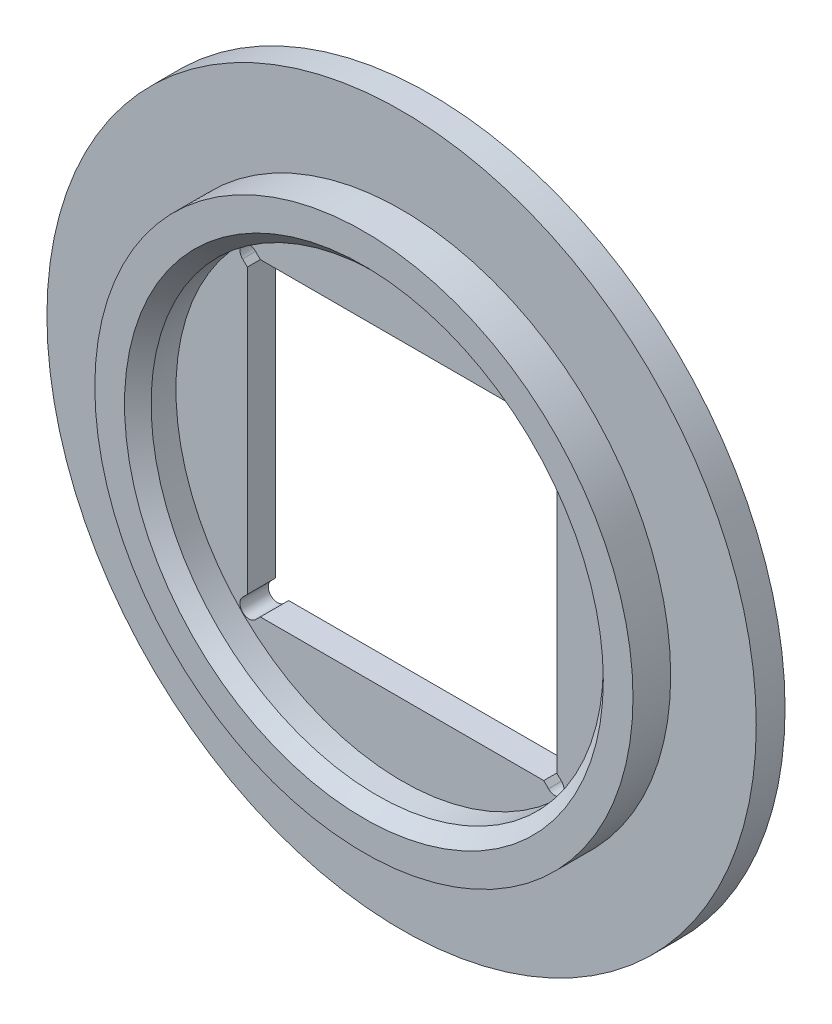
ISO-10303-21;
HEADER;
FILE_DESCRIPTION(('STEP AP214'),'2;1');
FILE_NAME('part.step','',(''),(''),'','','');
FILE_SCHEMA(('AUTOMOTIVE_DESIGN { 1 0 10303 214 1 1 1 1 }'));
ENDSEC;
DATA;
#1=APPLICATION_CONTEXT('core data for automotive mechanical design processes');
#2=APPLICATION_PROTOCOL_DEFINITION('international standard','automotive_design',2000,#1);
#3=PRODUCT_CONTEXT('',#1,'mechanical');
#4=PRODUCT('Part','Part','',(#3));
#5=PRODUCT_RELATED_PRODUCT_CATEGORY('part','',(#4));
#6=PRODUCT_DEFINITION_FORMATION('','',#4);
#7=PRODUCT_DEFINITION_CONTEXT('part definition',#1,'design');
#8=PRODUCT_DEFINITION('design','',#6,#7);
#9=PRODUCT_DEFINITION_SHAPE('','',#8);
#10=(LENGTH_UNIT() NAMED_UNIT(*) SI_UNIT(.MILLI.,.METRE.));
#11=(NAMED_UNIT(*) PLANE_ANGLE_UNIT() SI_UNIT($,.RADIAN.));
#12=(NAMED_UNIT(*) SI_UNIT($,.STERADIAN.) SOLID_ANGLE_UNIT());
#13=UNCERTAINTY_MEASURE_WITH_UNIT(LENGTH_MEASURE(1.E-05),#10,'distance_accuracy_value','');
#14=(GEOMETRIC_REPRESENTATION_CONTEXT(3) GLOBAL_UNCERTAINTY_ASSIGNED_CONTEXT((#13)) GLOBAL_UNIT_ASSIGNED_CONTEXT((#10,
#11,#12)) REPRESENTATION_CONTEXT('',''));
#15=CARTESIAN_POINT('',(0.,0.,0.));
#16=DIRECTION('',(0.,0.,1.));
#17=DIRECTION('',(1.,0.,0.));
#18=AXIS2_PLACEMENT_3D('',#15,#16,#17);
#19=CARTESIAN_POINT('',(3.49,-3.49,10.5112106653642));
#20=DIRECTION('',(0.,1.,0.));
#21=DIRECTION('',(0.,0.,1.));
#22=AXIS2_PLACEMENT_3D('',#19,#20,#21);
#23=PLANE('',#22);
#24=DIRECTION('',(0.,0.,-1.));
#25=VECTOR('',#24,1.);
#26=CARTESIAN_POINT('',(-3.19674366255217,-3.49,10.5112106653642));
#27=LINE('',#26,#25);
#28=CARTESIAN_POINT('',(-3.19674366255217,-3.49,0.64));
#29=VERTEX_POINT('',#28);
#30=CARTESIAN_POINT('',(-3.19674366255217,-3.49,0.));
#31=VERTEX_POINT('',#30);
#32=EDGE_CURVE('E511',#29,#31,#27,.T.);
#33=ORIENTED_EDGE('',*,*,#32,.F.);
#34=DIRECTION('',(1.,0.,0.));
#35=VECTOR('',#34,1.);
#36=CARTESIAN_POINT('',(3.49,-3.49,0.64));
#37=LINE('',#36,#35);
#38=CARTESIAN_POINT('',(3.19674366255217,-3.49,0.64));
#39=VERTEX_POINT('',#38);
#40=EDGE_CURVE('E249',#29,#39,#37,.T.);
#41=ORIENTED_EDGE('',*,*,#40,.T.);
#42=DIRECTION('',(0.,0.,1.));
#43=VECTOR('',#42,1.);
#44=CARTESIAN_POINT('',(3.19674366255217,-3.49,10.5112106653642));
#45=LINE('',#44,#43);
#46=CARTESIAN_POINT('',(3.19674366255217,-3.49,0.));
#47=VERTEX_POINT('',#46);
#48=EDGE_CURVE('E481',#47,#39,#45,.T.);
#49=ORIENTED_EDGE('',*,*,#48,.F.);
#50=DIRECTION('',(1.,0.,0.));
#51=VECTOR('',#50,1.);
#52=CARTESIAN_POINT('',(3.49,-3.49,0.));
#53=LINE('',#52,#51);
#54=EDGE_CURVE('E226',#31,#47,#53,.T.);
#55=ORIENTED_EDGE('',*,*,#54,.F.);
#56=EDGE_LOOP('',(#33,#41,#49,#55));
#57=FACE_BOUND('',#56,.T.);
#58=ADVANCED_FACE('F44',(#57),#23,.T.);
#59=CARTESIAN_POINT('',(3.49,3.49,10.5112106653642));
#60=DIRECTION('',(-1.,0.,0.));
#61=DIRECTION('',(0.,-1.,0.));
#62=AXIS2_PLACEMENT_3D('',#59,#60,#61);
#63=PLANE('',#62);
#64=DIRECTION('',(0.,0.,-1.));
#65=VECTOR('',#64,1.);
#66=CARTESIAN_POINT('',(3.49,-3.19674366255216,10.5112106653642));
#67=LINE('',#66,#65);
#68=CARTESIAN_POINT('',(3.49,-3.19674366255216,0.64));
#69=VERTEX_POINT('',#68);
#70=CARTESIAN_POINT('',(3.49,-3.19674366255216,0.));
#71=VERTEX_POINT('',#70);
#72=EDGE_CURVE('E504',#69,#71,#67,.T.);
#73=ORIENTED_EDGE('',*,*,#72,.F.);
#74=DIRECTION('',(0.,1.,0.));
#75=VECTOR('',#74,1.);
#76=CARTESIAN_POINT('',(3.49,3.49,0.64));
#77=LINE('',#76,#75);
#78=CARTESIAN_POINT('',(3.49,3.19674366255215,0.64));
#79=VERTEX_POINT('',#78);
#80=EDGE_CURVE('E245',#69,#79,#77,.T.);
#81=ORIENTED_EDGE('',*,*,#80,.T.);
#82=DIRECTION('',(0.,0.,1.));
#83=VECTOR('',#82,1.);
#84=CARTESIAN_POINT('',(3.49,3.19674366255215,10.5112106653642));
#85=LINE('',#84,#83);
#86=CARTESIAN_POINT('',(3.49,3.19674366255215,0.));
#87=VERTEX_POINT('',#86);
#88=EDGE_CURVE('E480',#87,#79,#85,.T.);
#89=ORIENTED_EDGE('',*,*,#88,.F.);
#90=DIRECTION('',(0.,1.,0.));
#91=VECTOR('',#90,1.);
#92=CARTESIAN_POINT('',(3.49,3.49,0.));
#93=LINE('',#92,#91);
#94=EDGE_CURVE('E183',#71,#87,#93,.T.);
#95=ORIENTED_EDGE('',*,*,#94,.F.);
#96=EDGE_LOOP('',(#73,#81,#89,#95));
#97=FACE_BOUND('',#96,.T.);
#98=ADVANCED_FACE('F297',(#97),#63,.T.);
#99=CARTESIAN_POINT('',(-3.49,3.49,10.5112106653642));
#100=DIRECTION('',(0.,-1.,0.));
#101=DIRECTION('',(0.,0.,-1.));
#102=AXIS2_PLACEMENT_3D('',#99,#100,#101);
#103=PLANE('',#102);
#104=DIRECTION('',(0.,0.,-1.));
#105=VECTOR('',#104,1.);
#106=CARTESIAN_POINT('',(3.19674366255217,3.49,10.5112106653642));
#107=LINE('',#106,#105);
#108=CARTESIAN_POINT('',(3.19674366255217,3.49,0.64));
#109=VERTEX_POINT('',#108);
#110=CARTESIAN_POINT('',(3.19674366255217,3.49,0.));
#111=VERTEX_POINT('',#110);
#112=EDGE_CURVE('E476',#109,#111,#107,.T.);
#113=ORIENTED_EDGE('',*,*,#112,.F.);
#114=DIRECTION('',(-1.,0.,0.));
#115=VECTOR('',#114,1.);
#116=CARTESIAN_POINT('',(-3.49,3.49,0.64));
#117=LINE('',#116,#115);
#118=CARTESIAN_POINT('',(-3.19674366255216,3.49,0.64));
#119=VERTEX_POINT('',#118);
#120=EDGE_CURVE('E240',#109,#119,#117,.T.);
#121=ORIENTED_EDGE('',*,*,#120,.T.);
#122=DIRECTION('',(0.,0.,1.));
#123=VECTOR('',#122,1.);
#124=CARTESIAN_POINT('',(-3.19674366255216,3.49,10.5112106653642));
#125=LINE('',#124,#123);
#126=CARTESIAN_POINT('',(-3.19674366255216,3.49,0.));
#127=VERTEX_POINT('',#126);
#128=EDGE_CURVE('E205',#127,#119,#125,.T.);
#129=ORIENTED_EDGE('',*,*,#128,.F.);
#130=DIRECTION('',(-1.,0.,0.));
#131=VECTOR('',#130,1.);
#132=CARTESIAN_POINT('',(-3.49,3.49,0.));
#133=LINE('',#132,#131);
#134=EDGE_CURVE('E231',#111,#127,#133,.T.);
#135=ORIENTED_EDGE('',*,*,#134,.F.);
#136=EDGE_LOOP('',(#113,#121,#129,#135));
#137=FACE_BOUND('',#136,.T.);
#138=ADVANCED_FACE('F302',(#137),#103,.T.);
#139=CARTESIAN_POINT('',(-3.49,0.,10.5112106653642));
#140=DIRECTION('',(1.,0.,0.));
#141=DIRECTION('',(0.,0.,-1.));
#142=AXIS2_PLACEMENT_3D('',#139,#140,#141);
#143=PLANE('',#142);
#144=DIRECTION('',(0.,0.,1.));
#145=VECTOR('',#144,1.);
#146=CARTESIAN_POINT('',(-3.49,-3.19674366255216,10.5112106653642));
#147=LINE('',#146,#145);
#148=CARTESIAN_POINT('',(-3.49,-3.19674366255216,0.));
#149=VERTEX_POINT('',#148);
#150=CARTESIAN_POINT('',(-3.49,-3.19674366255216,0.64));
#151=VERTEX_POINT('',#150);
#152=EDGE_CURVE('E514',#149,#151,#147,.T.);
#153=ORIENTED_EDGE('',*,*,#152,.F.);
#154=DIRECTION('',(0.,-1.,0.));
#155=VECTOR('',#154,1.);
#156=CARTESIAN_POINT('',(-3.49,0.,0.));
#157=LINE('',#156,#155);
#158=CARTESIAN_POINT('',(-3.49,3.19674366255216,0.));
#159=VERTEX_POINT('',#158);
#160=EDGE_CURVE('E227',#159,#149,#157,.T.);
#161=ORIENTED_EDGE('',*,*,#160,.F.);
#162=DIRECTION('',(0.,0.,-1.));
#163=VECTOR('',#162,1.);
#164=CARTESIAN_POINT('',(-3.49,3.19674366255216,10.5112106653642));
#165=LINE('',#164,#163);
#166=CARTESIAN_POINT('',(-3.49,3.19674366255216,0.64));
#167=VERTEX_POINT('',#166);
#168=EDGE_CURVE('E515',#167,#159,#165,.T.);
#169=ORIENTED_EDGE('',*,*,#168,.F.);
#170=DIRECTION('',(0.,-1.,0.));
#171=VECTOR('',#170,1.);
#172=CARTESIAN_POINT('',(-3.49,0.,0.64));
#173=LINE('',#172,#171);
#174=EDGE_CURVE('E230',#167,#151,#173,.T.);
#175=ORIENTED_EDGE('',*,*,#174,.T.);
#176=EDGE_LOOP('',(#153,#161,#169,#175));
#177=FACE_BOUND('',#176,.T.);
#178=ADVANCED_FACE('F324',(#177),#143,.T.);
#179=CARTESIAN_POINT('',(0.,0.,0.));
#180=DIRECTION('',(0.,0.,1.));
#181=DIRECTION('',(1.,0.,0.));
#182=AXIS2_PLACEMENT_3D('',#179,#180,#181);
#183=PLANE('',#182);
#184=ORIENTED_EDGE('',*,*,#160,.T.);
#185=DIRECTION('',(0.707106781186546,0.707106781186549,0.));
#186=VECTOR('',#185,1.);
#187=CARTESIAN_POINT('',(-0.146628168723927,0.146628168723926,0.));
#188=LINE('',#187,#186);
#189=CARTESIAN_POINT('',(-3.59662816872392,-3.30337183127608,0.));
#190=VERTEX_POINT('',#189);
#191=EDGE_CURVE('E558',#190,#149,#188,.T.);
#192=ORIENTED_EDGE('',*,*,#191,.F.);
#193=CARTESIAN_POINT('',(-3.45,-3.45,0.));
#194=DIRECTION('',(0.,0.,1.));
#195=DIRECTION('',(1.,0.,0.));
#196=AXIS2_PLACEMENT_3D('',#193,#194,#195);
#197=CIRCLE('',#196,0.207363544835296);
#198=CARTESIAN_POINT('',(-3.30337183127608,-3.59662816872392,0.));
#199=VERTEX_POINT('',#198);
#200=EDGE_CURVE('E212',#190,#199,#197,.T.);
#201=ORIENTED_EDGE('',*,*,#200,.T.);
#202=DIRECTION('',(-0.707106781186543,-0.707106781186552,0.));
#203=VECTOR('',#202,1.);
#204=CARTESIAN_POINT('',(0.146628168723897,-0.146628168723895,0.));
#205=LINE('',#204,#203);
#206=EDGE_CURVE('E554',#31,#199,#205,.T.);
#207=ORIENTED_EDGE('',*,*,#206,.F.);
#208=ORIENTED_EDGE('',*,*,#54,.T.);
#209=DIRECTION('',(-0.707106781186544,0.707106781186551,0.));
#210=VECTOR('',#209,1.);
#211=CARTESIAN_POINT('',(-0.146628168723902,-0.1466281687239,0.));
#212=LINE('',#211,#210);
#213=CARTESIAN_POINT('',(3.30337183127608,-3.59662816872392,0.));
#214=VERTEX_POINT('',#213);
#215=EDGE_CURVE('E537',#214,#47,#212,.T.);
#216=ORIENTED_EDGE('',*,*,#215,.F.);
#217=CARTESIAN_POINT('',(3.45,-3.45,0.));
#218=DIRECTION('',(0.,0.,1.));
#219=DIRECTION('',(1.,0.,0.));
#220=AXIS2_PLACEMENT_3D('',#217,#218,#219);
#221=CIRCLE('',#220,0.207363544835296);
#222=CARTESIAN_POINT('',(3.59662816872392,-3.30337183127608,0.));
#223=VERTEX_POINT('',#222);
#224=EDGE_CURVE('E202',#214,#223,#221,.T.);
#225=ORIENTED_EDGE('',*,*,#224,.T.);
#226=DIRECTION('',(0.707106781186547,-0.707106781186548,0.));
#227=VECTOR('',#226,1.);
#228=CARTESIAN_POINT('',(0.146628168723921,0.146628168723921,0.));
#229=LINE('',#228,#227);
#230=EDGE_CURVE('E534',#71,#223,#229,.T.);
#231=ORIENTED_EDGE('',*,*,#230,.F.);
#232=ORIENTED_EDGE('',*,*,#94,.T.);
#233=DIRECTION('',(-0.707106781186548,-0.707106781186547,0.));
#234=VECTOR('',#233,1.);
#235=CARTESIAN_POINT('',(0.146628168723922,-0.146628168723922,0.));
#236=LINE('',#235,#234);
#237=CARTESIAN_POINT('',(3.59662816872392,3.30337183127608,0.));
#238=VERTEX_POINT('',#237);
#239=EDGE_CURVE('E161',#238,#87,#236,.T.);
#240=ORIENTED_EDGE('',*,*,#239,.F.);
#241=CARTESIAN_POINT('',(3.45,3.45,0.));
#242=DIRECTION('',(0.,0.,1.));
#243=DIRECTION('',(1.,0.,0.));
#244=AXIS2_PLACEMENT_3D('',#241,#242,#243);
#245=CIRCLE('',#244,0.207363544835296);
#246=CARTESIAN_POINT('',(3.30337183127608,3.59662816872391,0.));
#247=VERTEX_POINT('',#246);
#248=EDGE_CURVE('E180',#238,#247,#245,.T.);
#249=ORIENTED_EDGE('',*,*,#248,.T.);
#250=DIRECTION('',(0.707106781186545,0.70710678118655,0.));
#251=VECTOR('',#250,1.);
#252=CARTESIAN_POINT('',(-0.1466281687239,0.146628168723899,0.));
#253=LINE('',#252,#251);
#254=EDGE_CURVE('E185',#111,#247,#253,.T.);
#255=ORIENTED_EDGE('',*,*,#254,.F.);
#256=ORIENTED_EDGE('',*,*,#134,.T.);
#257=DIRECTION('',(0.707106781186543,-0.707106781186552,0.));
#258=VECTOR('',#257,1.);
#259=CARTESIAN_POINT('',(0.146628168723899,0.146628168723897,0.));
#260=LINE('',#259,#258);
#261=CARTESIAN_POINT('',(-3.30337183127608,3.59662816872392,0.));
#262=VERTEX_POINT('',#261);
#263=EDGE_CURVE('E170',#262,#127,#260,.T.);
#264=ORIENTED_EDGE('',*,*,#263,.F.);
#265=CARTESIAN_POINT('',(-3.45,3.45,0.));
#266=DIRECTION('',(0.,0.,1.));
#267=DIRECTION('',(1.,0.,0.));
#268=AXIS2_PLACEMENT_3D('',#265,#266,#267);
#269=CIRCLE('',#268,0.207363544835296);
#270=CARTESIAN_POINT('',(-3.59662816872392,3.30337183127608,0.));
#271=VERTEX_POINT('',#270);
#272=EDGE_CURVE('E198',#262,#271,#269,.T.);
#273=ORIENTED_EDGE('',*,*,#272,.T.);
#274=DIRECTION('',(-0.707106781186546,0.707106781186549,0.));
#275=VECTOR('',#274,1.);
#276=CARTESIAN_POINT('',(-0.146628168723925,-0.146628168723925,0.));
#277=LINE('',#276,#275);
#278=EDGE_CURVE('E61',#159,#271,#277,.T.);
#279=ORIENTED_EDGE('',*,*,#278,.F.);
#280=EDGE_LOOP('',(#184,#192,#201,#207,#208,#216,#225,#231,#232,#240,#249,#255,#256,#264,#273,#279));
#281=FACE_BOUND('',#280,.T.);
#282=CARTESIAN_POINT('',(0.,0.,0.));
#283=DIRECTION('',(0.,0.,1.));
#284=DIRECTION('',(1.,0.,0.));
#285=AXIS2_PLACEMENT_3D('',#282,#283,#284);
#286=CIRCLE('',#285,8.);
#287=CARTESIAN_POINT('',(8.,0.,0.));
#288=VERTEX_POINT('',#287);
#289=EDGE_CURVE('E264',#288,#288,#286,.T.);
#290=ORIENTED_EDGE('',*,*,#289,.F.);
#291=EDGE_LOOP('',(#290));
#292=FACE_BOUND('',#291,.T.);
#293=ADVANCED_FACE('F177',(#281,#292),#183,.F.);
#294=CARTESIAN_POINT('',(0.,0.,0.65));
#295=DIRECTION('',(0.,0.,-1.));
#296=DIRECTION('',(-1.,0.,0.));
#297=AXIS2_PLACEMENT_3D('',#294,#295,#296);
#298=CYLINDRICAL_SURFACE('',#297,8.);
#299=CARTESIAN_POINT('',(0.,0.,0.65));
#300=DIRECTION('',(0.,0.,1.));
#301=DIRECTION('',(1.,0.,0.));
#302=AXIS2_PLACEMENT_3D('',#299,#300,#301);
#303=CIRCLE('',#302,8.);
#304=CARTESIAN_POINT('',(8.,0.,0.65));
#305=VERTEX_POINT('',#304);
#306=EDGE_CURVE('E268',#305,#305,#303,.T.);
#307=ORIENTED_EDGE('',*,*,#306,.F.);
#308=EDGE_LOOP('',(#307));
#309=FACE_BOUND('',#308,.T.);
#310=ORIENTED_EDGE('',*,*,#289,.T.);
#311=EDGE_LOOP('',(#310));
#312=FACE_BOUND('',#311,.T.);
#313=ADVANCED_FACE('F321',(#309,#312),#298,.T.);
#314=CARTESIAN_POINT('',(0.,0.,0.65));
#315=DIRECTION('',(0.,0.,1.));
#316=DIRECTION('',(1.,0.,0.));
#317=AXIS2_PLACEMENT_3D('',#314,#315,#316);
#318=PLANE('',#317);
#319=CARTESIAN_POINT('',(0.,0.,0.65));
#320=DIRECTION('',(0.,0.,1.));
#321=DIRECTION('',(1.,0.,0.));
#322=AXIS2_PLACEMENT_3D('',#319,#320,#321);
#323=CIRCLE('',#322,6.07);
#324=CARTESIAN_POINT('',(6.07,0.,0.65));
#325=VERTEX_POINT('',#324);
#326=EDGE_CURVE('E259',#325,#325,#323,.T.);
#327=ORIENTED_EDGE('',*,*,#326,.F.);
#328=EDGE_LOOP('',(#327));
#329=FACE_BOUND('',#328,.T.);
#330=ORIENTED_EDGE('',*,*,#306,.T.);
#331=EDGE_LOOP('',(#330));
#332=FACE_BOUND('',#331,.T.);
#333=ADVANCED_FACE('F314',(#329,#332),#318,.T.);
#334=CARTESIAN_POINT('',(0.,0.,1.5));
#335=DIRECTION('',(0.,0.,1.));
#336=DIRECTION('',(1.,0.,0.));
#337=AXIS2_PLACEMENT_3D('',#334,#335,#336);
#338=PLANE('',#337);
#339=CARTESIAN_POINT('',(0.,0.,1.5));
#340=DIRECTION('',(0.,0.,1.));
#341=DIRECTION('',(1.,0.,0.));
#342=AXIS2_PLACEMENT_3D('',#339,#340,#341);
#343=CIRCLE('',#342,5.40000000000001);
#344=CARTESIAN_POINT('',(5.40000000000001,0.,1.5));
#345=VERTEX_POINT('',#344);
#346=EDGE_CURVE('E11',#345,#345,#343,.F.);
#347=ORIENTED_EDGE('',*,*,#346,.T.);
#348=EDGE_LOOP('',(#347));
#349=FACE_BOUND('',#348,.T.);
#350=CARTESIAN_POINT('',(0.,0.,1.5));
#351=DIRECTION('',(0.,0.,1.));
#352=DIRECTION('',(1.,0.,0.));
#353=AXIS2_PLACEMENT_3D('',#350,#351,#352);
#354=CIRCLE('',#353,6.07);
#355=CARTESIAN_POINT('',(6.07,0.,1.5));
#356=VERTEX_POINT('',#355);
#357=EDGE_CURVE('E260',#356,#356,#354,.T.);
#358=ORIENTED_EDGE('',*,*,#357,.T.);
#359=EDGE_LOOP('',(#358));
#360=FACE_BOUND('',#359,.T.);
#361=ADVANCED_FACE('F311',(#349,#360),#338,.T.);
#362=CARTESIAN_POINT('',(0.,0.,1.5));
#363=DIRECTION('',(0.,0.,-1.));
#364=DIRECTION('',(-1.,0.,0.));
#365=AXIS2_PLACEMENT_3D('',#362,#363,#364);
#366=CYLINDRICAL_SURFACE('',#365,6.07);
#367=ORIENTED_EDGE('',*,*,#357,.F.);
#368=EDGE_LOOP('',(#367));
#369=FACE_BOUND('',#368,.T.);
#370=ORIENTED_EDGE('',*,*,#326,.T.);
#371=EDGE_LOOP('',(#370));
#372=FACE_BOUND('',#371,.T.);
#373=ADVANCED_FACE('F310',(#369,#372),#366,.T.);
#374=CARTESIAN_POINT('',(0.,0.,1.5));
#375=DIRECTION('',(0.,0.,-1.));
#376=DIRECTION('',(-1.,0.,0.));
#377=AXIS2_PLACEMENT_3D('',#374,#375,#376);
#378=CYLINDRICAL_SURFACE('',#377,5.1);
#379=CARTESIAN_POINT('',(0.,0.,1.2));
#380=DIRECTION('',(0.,0.,1.));
#381=DIRECTION('',(1.,0.,0.));
#382=AXIS2_PLACEMENT_3D('',#379,#380,#381);
#383=CIRCLE('',#382,5.1);
#384=CARTESIAN_POINT('',(5.1,0.,1.2));
#385=VERTEX_POINT('',#384);
#386=EDGE_CURVE('E54',#385,#385,#383,.T.);
#387=ORIENTED_EDGE('',*,*,#386,.T.);
#388=EDGE_LOOP('',(#387));
#389=FACE_BOUND('',#388,.T.);
#390=CARTESIAN_POINT('',(0.,0.,0.64));
#391=DIRECTION('',(0.,0.,1.));
#392=DIRECTION('',(1.,0.,0.));
#393=AXIS2_PLACEMENT_3D('',#390,#391,#392);
#394=CIRCLE('',#393,5.1);
#395=CARTESIAN_POINT('',(5.1,0.,0.64));
#396=VERTEX_POINT('',#395);
#397=EDGE_CURVE('E244',#396,#396,#394,.T.);
#398=ORIENTED_EDGE('',*,*,#397,.F.);
#399=EDGE_LOOP('',(#398));
#400=FACE_BOUND('',#399,.T.);
#401=ADVANCED_FACE('F280',(#389,#400),#378,.F.);
#402=CARTESIAN_POINT('',(0.,0.,0.64));
#403=DIRECTION('',(0.,0.,1.));
#404=DIRECTION('',(1.,0.,0.));
#405=AXIS2_PLACEMENT_3D('',#402,#403,#404);
#406=PLANE('',#405);
#407=DIRECTION('',(0.707106781186546,0.707106781186549,0.));
#408=VECTOR('',#407,1.);
#409=CARTESIAN_POINT('',(-0.146628168723927,0.146628168723926,0.64));
#410=LINE('',#409,#408);
#411=CARTESIAN_POINT('',(-3.59662816872392,-3.30337183127608,0.64));
#412=VERTEX_POINT('',#411);
#413=EDGE_CURVE('E557',#412,#151,#410,.T.);
#414=ORIENTED_EDGE('',*,*,#413,.T.);
#415=ORIENTED_EDGE('',*,*,#174,.F.);
#416=DIRECTION('',(-0.707106781186546,0.707106781186549,0.));
#417=VECTOR('',#416,1.);
#418=CARTESIAN_POINT('',(-0.146628168723925,-0.146628168723925,0.64));
#419=LINE('',#418,#417);
#420=CARTESIAN_POINT('',(-3.59662816872392,3.30337183127608,0.64));
#421=VERTEX_POINT('',#420);
#422=EDGE_CURVE('E490',#167,#421,#419,.T.);
#423=ORIENTED_EDGE('',*,*,#422,.T.);
#424=CARTESIAN_POINT('',(-3.45,3.45,0.64));
#425=DIRECTION('',(0.,0.,1.));
#426=DIRECTION('',(1.,0.,0.));
#427=AXIS2_PLACEMENT_3D('',#424,#425,#426);
#428=CIRCLE('',#427,0.207363544835296);
#429=CARTESIAN_POINT('',(-3.30337183127608,3.59662816872392,0.64));
#430=VERTEX_POINT('',#429);
#431=EDGE_CURVE('E222',#430,#421,#428,.T.);
#432=ORIENTED_EDGE('',*,*,#431,.F.);
#433=DIRECTION('',(0.707106781186543,-0.707106781186552,0.));
#434=VECTOR('',#433,1.);
#435=CARTESIAN_POINT('',(0.146628168723899,0.146628168723897,0.64));
#436=LINE('',#435,#434);
#437=EDGE_CURVE('E69',#430,#119,#436,.T.);
#438=ORIENTED_EDGE('',*,*,#437,.T.);
#439=ORIENTED_EDGE('',*,*,#120,.F.);
#440=DIRECTION('',(0.707106781186545,0.70710678118655,0.));
#441=VECTOR('',#440,1.);
#442=CARTESIAN_POINT('',(-0.1466281687239,0.146628168723899,0.64));
#443=LINE('',#442,#441);
#444=CARTESIAN_POINT('',(3.30337183127608,3.59662816872391,0.64));
#445=VERTEX_POINT('',#444);
#446=EDGE_CURVE('E486',#109,#445,#443,.T.);
#447=ORIENTED_EDGE('',*,*,#446,.T.);
#448=CARTESIAN_POINT('',(3.45,3.45,0.64));
#449=DIRECTION('',(0.,0.,1.));
#450=DIRECTION('',(1.,0.,0.));
#451=AXIS2_PLACEMENT_3D('',#448,#449,#450);
#452=CIRCLE('',#451,0.207363544835296);
#453=CARTESIAN_POINT('',(3.59662816872392,3.30337183127608,0.64));
#454=VERTEX_POINT('',#453);
#455=EDGE_CURVE('E191',#454,#445,#452,.T.);
#456=ORIENTED_EDGE('',*,*,#455,.F.);
#457=DIRECTION('',(-0.707106781186548,-0.707106781186547,0.));
#458=VECTOR('',#457,1.);
#459=CARTESIAN_POINT('',(0.146628168723922,-0.146628168723922,0.64));
#460=LINE('',#459,#458);
#461=EDGE_CURVE('E164',#454,#79,#460,.T.);
#462=ORIENTED_EDGE('',*,*,#461,.T.);
#463=ORIENTED_EDGE('',*,*,#80,.F.);
#464=DIRECTION('',(0.707106781186547,-0.707106781186548,0.));
#465=VECTOR('',#464,1.);
#466=CARTESIAN_POINT('',(0.146628168723921,0.146628168723921,0.64));
#467=LINE('',#466,#465);
#468=CARTESIAN_POINT('',(3.59662816872392,-3.30337183127608,0.64));
#469=VERTEX_POINT('',#468);
#470=EDGE_CURVE('E544',#69,#469,#467,.T.);
#471=ORIENTED_EDGE('',*,*,#470,.T.);
#472=CARTESIAN_POINT('',(3.45,-3.45,0.64));
#473=DIRECTION('',(0.,0.,1.));
#474=DIRECTION('',(1.,0.,0.));
#475=AXIS2_PLACEMENT_3D('',#472,#473,#474);
#476=CIRCLE('',#475,0.207363544835296);
#477=CARTESIAN_POINT('',(3.30337183127608,-3.59662816872391,0.64));
#478=VERTEX_POINT('',#477);
#479=EDGE_CURVE('E192',#478,#469,#476,.T.);
#480=ORIENTED_EDGE('',*,*,#479,.F.);
#481=DIRECTION('',(-0.707106781186544,0.707106781186551,0.));
#482=VECTOR('',#481,1.);
#483=CARTESIAN_POINT('',(-0.146628168723902,-0.1466281687239,0.64));
#484=LINE('',#483,#482);
#485=EDGE_CURVE('E536',#478,#39,#484,.T.);
#486=ORIENTED_EDGE('',*,*,#485,.T.);
#487=ORIENTED_EDGE('',*,*,#40,.F.);
#488=DIRECTION('',(-0.707106781186543,-0.707106781186552,0.));
#489=VECTOR('',#488,1.);
#490=CARTESIAN_POINT('',(0.146628168723897,-0.146628168723895,0.64));
#491=LINE('',#490,#489);
#492=CARTESIAN_POINT('',(-3.30337183127608,-3.59662816872392,0.64));
#493=VERTEX_POINT('',#492);
#494=EDGE_CURVE('E563',#29,#493,#491,.T.);
#495=ORIENTED_EDGE('',*,*,#494,.T.);
#496=CARTESIAN_POINT('',(-3.45,-3.45,0.64));
#497=DIRECTION('',(0.,0.,1.));
#498=DIRECTION('',(1.,0.,0.));
#499=AXIS2_PLACEMENT_3D('',#496,#497,#498);
#500=CIRCLE('',#499,0.207363544835296);
#501=EDGE_CURVE('E210',#412,#493,#500,.T.);
#502=ORIENTED_EDGE('',*,*,#501,.F.);
#503=EDGE_LOOP('',(#414,#415,#423,#432,#438,#439,#447,#456,#462,#463,#471,#480,#486,#487,#495,#502));
#504=FACE_BOUND('',#503,.T.);
#505=ORIENTED_EDGE('',*,*,#397,.T.);
#506=EDGE_LOOP('',(#505));
#507=FACE_BOUND('',#506,.T.);
#508=ADVANCED_FACE('F285',(#504,#507),#406,.T.);
#509=CARTESIAN_POINT('',(0.,0.,1.2));
#510=DIRECTION('',(0.,0.,1.));
#511=DIRECTION('',(1.,0.,0.));
#512=AXIS2_PLACEMENT_3D('',#509,#510,#511);
#513=CONICAL_SURFACE('',#512,5.1,0.785398163397457);
#514=ORIENTED_EDGE('',*,*,#346,.F.);
#515=EDGE_LOOP('',(#514));
#516=FACE_BOUND('',#515,.T.);
#517=ORIENTED_EDGE('',*,*,#386,.F.);
#518=EDGE_LOOP('',(#517));
#519=FACE_BOUND('',#518,.T.);
#520=ADVANCED_FACE('F47',(#516,#519),#513,.F.);
#521=CARTESIAN_POINT('',(-3.45,3.45,1.22651267489567));
#522=DIRECTION('',(0.,0.,-1.));
#523=DIRECTION('',(-1.,0.,0.));
#524=AXIS2_PLACEMENT_3D('',#521,#522,#523);
#525=CYLINDRICAL_SURFACE('',#524,0.207363544835296);
#526=DIRECTION('',(0.,0.,-1.));
#527=VECTOR('',#526,1.);
#528=CARTESIAN_POINT('',(-3.30337183127608,3.59662816872392,1.71970043698667));
#529=LINE('',#528,#527);
#530=EDGE_CURVE('E501',#430,#262,#529,.T.);
#531=ORIENTED_EDGE('',*,*,#530,.F.);
#532=ORIENTED_EDGE('',*,*,#431,.T.);
#533=DIRECTION('',(0.,0.,-1.));
#534=VECTOR('',#533,1.);
#535=CARTESIAN_POINT('',(-3.59662816872392,3.30337183127608,1.71970043698667));
#536=LINE('',#535,#534);
#537=EDGE_CURVE('E493',#421,#271,#536,.T.);
#538=ORIENTED_EDGE('',*,*,#537,.T.);
#539=ORIENTED_EDGE('',*,*,#272,.F.);
#540=EDGE_LOOP('',(#531,#532,#538,#539));
#541=FACE_BOUND('',#540,.T.);
#542=ADVANCED_FACE('F284',(#541),#525,.F.);
#543=CARTESIAN_POINT('',(-3.45,-3.45,1.22651267489567));
#544=DIRECTION('',(0.,0.,-1.));
#545=DIRECTION('',(-1.,0.,0.));
#546=AXIS2_PLACEMENT_3D('',#543,#544,#545);
#547=CYLINDRICAL_SURFACE('',#546,0.207363544835296);
#548=DIRECTION('',(0.,0.,-1.));
#549=VECTOR('',#548,1.);
#550=CARTESIAN_POINT('',(-3.59662816872392,-3.30337183127608,1.71970043698667));
#551=LINE('',#550,#549);
#552=EDGE_CURVE('E540',#412,#190,#551,.T.);
#553=ORIENTED_EDGE('',*,*,#552,.F.);
#554=ORIENTED_EDGE('',*,*,#501,.T.);
#555=DIRECTION('',(0.,0.,-1.));
#556=VECTOR('',#555,1.);
#557=CARTESIAN_POINT('',(-3.30337183127608,-3.59662816872392,1.71970043698667));
#558=LINE('',#557,#556);
#559=EDGE_CURVE('E567',#493,#199,#558,.T.);
#560=ORIENTED_EDGE('',*,*,#559,.T.);
#561=ORIENTED_EDGE('',*,*,#200,.F.);
#562=EDGE_LOOP('',(#553,#554,#560,#561));
#563=FACE_BOUND('',#562,.T.);
#564=ADVANCED_FACE('F290',(#563),#547,.F.);
#565=CARTESIAN_POINT('',(3.45,3.45,1.22651267489567));
#566=DIRECTION('',(0.,0.,-1.));
#567=DIRECTION('',(-1.,0.,0.));
#568=AXIS2_PLACEMENT_3D('',#565,#566,#567);
#569=CYLINDRICAL_SURFACE('',#568,0.207363544835296);
#570=DIRECTION('',(0.,0.,-1.));
#571=VECTOR('',#570,1.);
#572=CARTESIAN_POINT('',(3.59662816872392,3.30337183127608,1.71970043698667));
#573=LINE('',#572,#571);
#574=EDGE_CURVE('E158',#454,#238,#573,.T.);
#575=ORIENTED_EDGE('',*,*,#574,.F.);
#576=ORIENTED_EDGE('',*,*,#455,.T.);
#577=DIRECTION('',(0.,0.,-1.));
#578=VECTOR('',#577,1.);
#579=CARTESIAN_POINT('',(3.30337183127608,3.59662816872391,1.71970043698667));
#580=LINE('',#579,#578);
#581=EDGE_CURVE('E171',#445,#247,#580,.T.);
#582=ORIENTED_EDGE('',*,*,#581,.T.);
#583=ORIENTED_EDGE('',*,*,#248,.F.);
#584=EDGE_LOOP('',(#575,#576,#582,#583));
#585=FACE_BOUND('',#584,.T.);
#586=ADVANCED_FACE('F189',(#585),#569,.F.);
#587=CARTESIAN_POINT('',(3.45,-3.45,1.22651267489567));
#588=DIRECTION('',(0.,0.,-1.));
#589=DIRECTION('',(-1.,0.,0.));
#590=AXIS2_PLACEMENT_3D('',#587,#588,#589);
#591=CYLINDRICAL_SURFACE('',#590,0.207363544835296);
#592=DIRECTION('',(0.,0.,-1.));
#593=VECTOR('',#592,1.);
#594=CARTESIAN_POINT('',(3.30337183127608,-3.59662816872392,1.71970043698667));
#595=LINE('',#594,#593);
#596=EDGE_CURVE('E186',#478,#214,#595,.T.);
#597=ORIENTED_EDGE('',*,*,#596,.F.);
#598=ORIENTED_EDGE('',*,*,#479,.T.);
#599=DIRECTION('',(0.,0.,-1.));
#600=VECTOR('',#599,1.);
#601=CARTESIAN_POINT('',(3.59662816872392,-3.30337183127608,1.71970043698667));
#602=LINE('',#601,#600);
#603=EDGE_CURVE('E548',#469,#223,#602,.T.);
#604=ORIENTED_EDGE('',*,*,#603,.T.);
#605=ORIENTED_EDGE('',*,*,#224,.F.);
#606=EDGE_LOOP('',(#597,#598,#604,#605));
#607=FACE_BOUND('',#606,.T.);
#608=ADVANCED_FACE('F374',(#607),#591,.F.);
#609=CARTESIAN_POINT('',(0.146628168723921,0.146628168723921,1.71970043698667));
#610=DIRECTION('',(0.707106781186548,0.707106781186547,0.));
#611=DIRECTION('',(-0.707106781186547,0.707106781186548,0.));
#612=AXIS2_PLACEMENT_3D('',#609,#610,#611);
#613=PLANE('',#612);
#614=ORIENTED_EDGE('',*,*,#72,.T.);
#615=ORIENTED_EDGE('',*,*,#230,.T.);
#616=ORIENTED_EDGE('',*,*,#603,.F.);
#617=ORIENTED_EDGE('',*,*,#470,.F.);
#618=EDGE_LOOP('',(#614,#615,#616,#617));
#619=FACE_BOUND('',#618,.T.);
#620=ADVANCED_FACE('F382',(#619),#613,.F.);
#621=CARTESIAN_POINT('',(-0.146628168723902,-0.1466281687239,1.71970043698667));
#622=DIRECTION('',(-0.707106781186551,-0.707106781186544,0.));
#623=DIRECTION('',(0.707106781186544,-0.707106781186551,0.));
#624=AXIS2_PLACEMENT_3D('',#621,#622,#623);
#625=PLANE('',#624);
#626=ORIENTED_EDGE('',*,*,#48,.T.);
#627=ORIENTED_EDGE('',*,*,#485,.F.);
#628=ORIENTED_EDGE('',*,*,#596,.T.);
#629=ORIENTED_EDGE('',*,*,#215,.T.);
#630=EDGE_LOOP('',(#626,#627,#628,#629));
#631=FACE_BOUND('',#630,.T.);
#632=ADVANCED_FACE('F392',(#631),#625,.F.);
#633=CARTESIAN_POINT('',(-0.1466281687239,0.146628168723899,1.71970043698667));
#634=DIRECTION('',(-0.707106781186551,0.707106781186545,0.));
#635=DIRECTION('',(-0.707106781186545,-0.70710678118655,0.));
#636=AXIS2_PLACEMENT_3D('',#633,#634,#635);
#637=PLANE('',#636);
#638=ORIENTED_EDGE('',*,*,#112,.T.);
#639=ORIENTED_EDGE('',*,*,#254,.T.);
#640=ORIENTED_EDGE('',*,*,#581,.F.);
#641=ORIENTED_EDGE('',*,*,#446,.F.);
#642=EDGE_LOOP('',(#638,#639,#640,#641));
#643=FACE_BOUND('',#642,.T.);
#644=ADVANCED_FACE('F402',(#643),#637,.F.);
#645=CARTESIAN_POINT('',(0.146628168723922,-0.146628168723922,1.71970043698667));
#646=DIRECTION('',(0.707106781186547,-0.707106781186548,0.));
#647=DIRECTION('',(0.707106781186548,0.707106781186547,0.));
#648=AXIS2_PLACEMENT_3D('',#645,#646,#647);
#649=PLANE('',#648);
#650=ORIENTED_EDGE('',*,*,#88,.T.);
#651=ORIENTED_EDGE('',*,*,#461,.F.);
#652=ORIENTED_EDGE('',*,*,#574,.T.);
#653=ORIENTED_EDGE('',*,*,#239,.T.);
#654=EDGE_LOOP('',(#650,#651,#652,#653));
#655=FACE_BOUND('',#654,.T.);
#656=ADVANCED_FACE('F160',(#655),#649,.F.);
#657=CARTESIAN_POINT('',(0.146628168723897,-0.146628168723895,1.71970043698667));
#658=DIRECTION('',(0.707106781186552,-0.707106781186543,0.));
#659=DIRECTION('',(0.707106781186543,0.707106781186552,0.));
#660=AXIS2_PLACEMENT_3D('',#657,#658,#659);
#661=PLANE('',#660);
#662=ORIENTED_EDGE('',*,*,#32,.T.);
#663=ORIENTED_EDGE('',*,*,#206,.T.);
#664=ORIENTED_EDGE('',*,*,#559,.F.);
#665=ORIENTED_EDGE('',*,*,#494,.F.);
#666=EDGE_LOOP('',(#662,#663,#664,#665));
#667=FACE_BOUND('',#666,.T.);
#668=ADVANCED_FACE('F421',(#667),#661,.F.);
#669=CARTESIAN_POINT('',(-0.146628168723927,0.146628168723926,1.71970043698667));
#670=DIRECTION('',(-0.707106781186549,0.707106781186546,0.));
#671=DIRECTION('',(-0.707106781186546,-0.707106781186549,0.));
#672=AXIS2_PLACEMENT_3D('',#669,#670,#671);
#673=PLANE('',#672);
#674=ORIENTED_EDGE('',*,*,#152,.T.);
#675=ORIENTED_EDGE('',*,*,#413,.F.);
#676=ORIENTED_EDGE('',*,*,#552,.T.);
#677=ORIENTED_EDGE('',*,*,#191,.T.);
#678=EDGE_LOOP('',(#674,#675,#676,#677));
#679=FACE_BOUND('',#678,.T.);
#680=ADVANCED_FACE('F430',(#679),#673,.F.);
#681=CARTESIAN_POINT('',(-0.146628168723925,-0.146628168723925,1.71970043698667));
#682=DIRECTION('',(-0.707106781186549,-0.707106781186546,0.));
#683=DIRECTION('',(0.707106781186546,-0.707106781186549,0.));
#684=AXIS2_PLACEMENT_3D('',#681,#682,#683);
#685=PLANE('',#684);
#686=ORIENTED_EDGE('',*,*,#168,.T.);
#687=ORIENTED_EDGE('',*,*,#278,.T.);
#688=ORIENTED_EDGE('',*,*,#537,.F.);
#689=ORIENTED_EDGE('',*,*,#422,.F.);
#690=EDGE_LOOP('',(#686,#687,#688,#689));
#691=FACE_BOUND('',#690,.T.);
#692=ADVANCED_FACE('F440',(#691),#685,.F.);
#693=CARTESIAN_POINT('',(0.146628168723899,0.146628168723897,1.71970043698667));
#694=DIRECTION('',(0.707106781186552,0.707106781186543,0.));
#695=DIRECTION('',(-0.707106781186543,0.707106781186552,0.));
#696=AXIS2_PLACEMENT_3D('',#693,#694,#695);
#697=PLANE('',#696);
#698=ORIENTED_EDGE('',*,*,#128,.T.);
#699=ORIENTED_EDGE('',*,*,#437,.F.);
#700=ORIENTED_EDGE('',*,*,#530,.T.);
#701=ORIENTED_EDGE('',*,*,#263,.T.);
#702=EDGE_LOOP('',(#698,#699,#700,#701));
#703=FACE_BOUND('',#702,.T.);
#704=ADVANCED_FACE('F450',(#703),#697,.F.);
#705=CLOSED_SHELL('',(#58,#98,#138,#178,#293,#313,#333,#361,#373,#401,#508,#520,#542,#564,#586,
#608,#620,#632,#644,#656,#668,#680,#692,#704));
#706=MANIFOLD_SOLID_BREP('B2',#705);
#707=ADVANCED_BREP_SHAPE_REPRESENTATION('',(#18,#706),#14);
#708=SHAPE_DEFINITION_REPRESENTATION(#9,#707);
ENDSEC;
END-ISO-10303-21;
